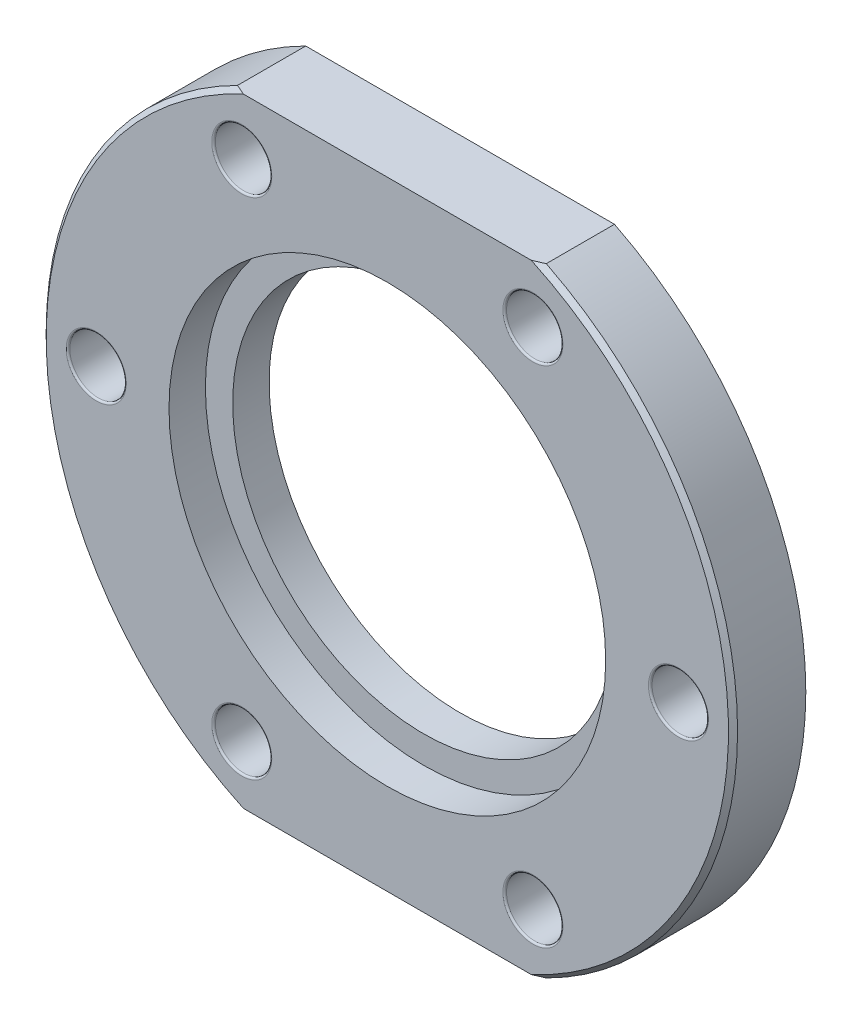
ISO-10303-21;
HEADER;
FILE_DESCRIPTION(('STEP AP214'),'2;1');
FILE_NAME('part.step','',(''),(''),'','','');
FILE_SCHEMA(('AUTOMOTIVE_DESIGN { 1 0 10303 214 1 1 1 1 }'));
ENDSEC;
DATA;
#1=APPLICATION_CONTEXT('core data for automotive mechanical design processes');
#2=APPLICATION_PROTOCOL_DEFINITION('international standard','automotive_design',2000,#1);
#3=PRODUCT_CONTEXT('',#1,'mechanical');
#4=PRODUCT('Part','Part','',(#3));
#5=PRODUCT_RELATED_PRODUCT_CATEGORY('part','',(#4));
#6=PRODUCT_DEFINITION_FORMATION('','',#4);
#7=PRODUCT_DEFINITION_CONTEXT('part definition',#1,'design');
#8=PRODUCT_DEFINITION('design','',#6,#7);
#9=PRODUCT_DEFINITION_SHAPE('','',#8);
#10=(LENGTH_UNIT() NAMED_UNIT(*) SI_UNIT(.MILLI.,.METRE.));
#11=(NAMED_UNIT(*) PLANE_ANGLE_UNIT() SI_UNIT($,.RADIAN.));
#12=(NAMED_UNIT(*) SI_UNIT($,.STERADIAN.) SOLID_ANGLE_UNIT());
#13=UNCERTAINTY_MEASURE_WITH_UNIT(LENGTH_MEASURE(1.E-05),#10,'distance_accuracy_value','');
#14=(GEOMETRIC_REPRESENTATION_CONTEXT(3) GLOBAL_UNCERTAINTY_ASSIGNED_CONTEXT((#13)) GLOBAL_UNIT_ASSIGNED_CONTEXT((#10,
#11,#12)) REPRESENTATION_CONTEXT('',''));
#15=CARTESIAN_POINT('',(0.,0.,0.));
#16=DIRECTION('',(0.,0.,1.));
#17=DIRECTION('',(1.,0.,0.));
#18=AXIS2_PLACEMENT_3D('',#15,#16,#17);
#19=CARTESIAN_POINT('',(0.,0.,4.));
#20=DIRECTION('',(0.,0.,-1.));
#21=DIRECTION('',(-1.,0.,0.));
#22=AXIS2_PLACEMENT_3D('',#19,#20,#21);
#23=CYLINDRICAL_SURFACE('',#22,19.);
#24=DIRECTION('',(0.,0.,1.));
#25=VECTOR('',#24,1.);
#26=CARTESIAN_POINT('',(-8.48528137423857,-17.,0.));
#27=LINE('',#26,#25);
#28=CARTESIAN_POINT('',(-8.48528137423857,-17.,0.));
#29=VERTEX_POINT('',#28);
#30=CARTESIAN_POINT('',(-8.48528137423857,-17.,3.75000000000001));
#31=VERTEX_POINT('',#30);
#32=EDGE_CURVE('E108',#29,#31,#27,.T.);
#33=ORIENTED_EDGE('',*,*,#32,.T.);
#34=CARTESIAN_POINT('',(0.,0.,3.75000000000001));
#35=DIRECTION('',(0.,0.,1.));
#36=DIRECTION('',(1.,0.,0.));
#37=AXIS2_PLACEMENT_3D('',#34,#35,#36);
#38=CIRCLE('',#37,19.);
#39=CARTESIAN_POINT('',(-8.48528137423857,17.,3.75000000000001));
#40=VERTEX_POINT('',#39);
#41=EDGE_CURVE('E11',#31,#40,#38,.F.);
#42=ORIENTED_EDGE('',*,*,#41,.T.);
#43=DIRECTION('',(0.,0.,1.));
#44=VECTOR('',#43,1.);
#45=CARTESIAN_POINT('',(-8.48528137423857,17.,0.));
#46=LINE('',#45,#44);
#47=CARTESIAN_POINT('',(-8.48528137423857,17.,0.));
#48=VERTEX_POINT('',#47);
#49=EDGE_CURVE('E355',#48,#40,#46,.T.);
#50=ORIENTED_EDGE('',*,*,#49,.F.);
#51=CARTESIAN_POINT('',(0.,0.,0.));
#52=DIRECTION('',(0.,0.,1.));
#53=DIRECTION('',(1.,0.,0.));
#54=AXIS2_PLACEMENT_3D('',#51,#52,#53);
#55=CIRCLE('',#54,19.);
#56=EDGE_CURVE('E126',#48,#29,#55,.T.);
#57=ORIENTED_EDGE('',*,*,#56,.T.);
#58=EDGE_LOOP('',(#33,#42,#50,#57));
#59=FACE_BOUND('',#58,.T.);
#60=ADVANCED_FACE('F49',(#59),#23,.T.);
#61=DIRECTION('',(0.,0.,1.));
#62=VECTOR('',#61,1.);
#63=CARTESIAN_POINT('',(8.48528137423857,17.,0.));
#64=LINE('',#63,#62);
#65=CARTESIAN_POINT('',(8.48528137423857,17.,0.));
#66=VERTEX_POINT('',#65);
#67=CARTESIAN_POINT('',(8.48528137423857,17.,3.75000000000001));
#68=VERTEX_POINT('',#67);
#69=EDGE_CURVE('E114',#66,#68,#64,.T.);
#70=ORIENTED_EDGE('',*,*,#69,.T.);
#71=CARTESIAN_POINT('',(0.,0.,3.75000000000001));
#72=DIRECTION('',(0.,0.,1.));
#73=DIRECTION('',(1.,0.,0.));
#74=AXIS2_PLACEMENT_3D('',#71,#72,#73);
#75=CIRCLE('',#74,19.);
#76=CARTESIAN_POINT('',(8.48528137423857,-17.,3.75000000000001));
#77=VERTEX_POINT('',#76);
#78=EDGE_CURVE('E75',#68,#77,#75,.F.);
#79=ORIENTED_EDGE('',*,*,#78,.T.);
#80=DIRECTION('',(0.,0.,1.));
#81=VECTOR('',#80,1.);
#82=CARTESIAN_POINT('',(8.48528137423857,-17.,0.));
#83=LINE('',#82,#81);
#84=CARTESIAN_POINT('',(8.48528137423857,-17.,0.));
#85=VERTEX_POINT('',#84);
#86=EDGE_CURVE('E106',#85,#77,#83,.T.);
#87=ORIENTED_EDGE('',*,*,#86,.F.);
#88=EDGE_CURVE('E118',#85,#66,#55,.T.);
#89=ORIENTED_EDGE('',*,*,#88,.T.);
#90=EDGE_LOOP('',(#70,#79,#87,#89));
#91=FACE_BOUND('',#90,.T.);
#92=ADVANCED_FACE('F117',(#91),#23,.T.);
#93=CARTESIAN_POINT('',(0.,0.,4.));
#94=DIRECTION('',(0.,0.,1.));
#95=DIRECTION('',(1.,0.,0.));
#96=AXIS2_PLACEMENT_3D('',#93,#94,#95);
#97=PLANE('',#96);
#98=CARTESIAN_POINT('',(0.,0.,4.));
#99=DIRECTION('',(0.,0.,1.));
#100=DIRECTION('',(1.,0.,0.));
#101=AXIS2_PLACEMENT_3D('',#98,#99,#100);
#102=CIRCLE('',#101,12.);
#103=CARTESIAN_POINT('',(12.,0.,4.));
#104=VERTEX_POINT('',#103);
#105=EDGE_CURVE('E236',#104,#104,#102,.F.);
#106=ORIENTED_EDGE('',*,*,#105,.T.);
#107=EDGE_LOOP('',(#106));
#108=FACE_BOUND('',#107,.T.);
#109=CARTESIAN_POINT('',(16.,-1.1172740284298E-13,4.));
#110=DIRECTION('',(0.,0.,1.));
#111=DIRECTION('',(1.,0.,0.));
#112=AXIS2_PLACEMENT_3D('',#109,#110,#111);
#113=CIRCLE('',#112,1.65);
#114=CARTESIAN_POINT('',(17.65,-1.1172740284298E-13,4.));
#115=VERTEX_POINT('',#114);
#116=EDGE_CURVE('E191',#115,#115,#113,.F.);
#117=ORIENTED_EDGE('',*,*,#116,.T.);
#118=EDGE_LOOP('',(#117));
#119=FACE_BOUND('',#118,.T.);
#120=CARTESIAN_POINT('',(7.99999999999987,-13.8564064605511,4.));
#121=DIRECTION('',(0.,0.,1.));
#122=DIRECTION('',(1.,0.,0.));
#123=AXIS2_PLACEMENT_3D('',#120,#121,#122);
#124=CIRCLE('',#123,1.65);
#125=CARTESIAN_POINT('',(9.64999999999987,-13.8564064605511,4.));
#126=VERTEX_POINT('',#125);
#127=EDGE_CURVE('E187',#126,#126,#124,.F.);
#128=ORIENTED_EDGE('',*,*,#127,.T.);
#129=EDGE_LOOP('',(#128));
#130=FACE_BOUND('',#129,.T.);
#131=CARTESIAN_POINT('',(-8.00000000000016,-13.8564064605509,4.));
#132=DIRECTION('',(0.,0.,1.));
#133=DIRECTION('',(1.,0.,0.));
#134=AXIS2_PLACEMENT_3D('',#131,#132,#133);
#135=CIRCLE('',#134,1.65);
#136=CARTESIAN_POINT('',(-6.35000000000016,-13.8564064605509,4.));
#137=VERTEX_POINT('',#136);
#138=EDGE_CURVE('E183',#137,#137,#135,.F.);
#139=ORIENTED_EDGE('',*,*,#138,.T.);
#140=EDGE_LOOP('',(#139));
#141=FACE_BOUND('',#140,.T.);
#142=CARTESIAN_POINT('',(-16.,0.,4.));
#143=DIRECTION('',(0.,0.,1.));
#144=DIRECTION('',(1.,0.,0.));
#145=AXIS2_PLACEMENT_3D('',#142,#143,#144);
#146=CIRCLE('',#145,1.65);
#147=CARTESIAN_POINT('',(-14.35,0.,4.));
#148=VERTEX_POINT('',#147);
#149=EDGE_CURVE('E179',#148,#148,#146,.F.);
#150=ORIENTED_EDGE('',*,*,#149,.T.);
#151=EDGE_LOOP('',(#150));
#152=FACE_BOUND('',#151,.T.);
#153=CARTESIAN_POINT('',(8.00000000000007,13.856406460551,4.));
#154=DIRECTION('',(0.,0.,1.));
#155=DIRECTION('',(1.,0.,0.));
#156=AXIS2_PLACEMENT_3D('',#153,#154,#155);
#157=CIRCLE('',#156,1.65);
#158=CARTESIAN_POINT('',(9.65000000000007,13.856406460551,4.));
#159=VERTEX_POINT('',#158);
#160=EDGE_CURVE('E175',#159,#159,#157,.F.);
#161=ORIENTED_EDGE('',*,*,#160,.T.);
#162=EDGE_LOOP('',(#161));
#163=FACE_BOUND('',#162,.T.);
#164=CARTESIAN_POINT('',(-7.99999999999997,13.856406460551,4.));
#165=DIRECTION('',(0.,0.,1.));
#166=DIRECTION('',(1.,0.,0.));
#167=AXIS2_PLACEMENT_3D('',#164,#165,#166);
#168=CIRCLE('',#167,1.65);
#169=CARTESIAN_POINT('',(-6.34999999999997,13.856406460551,4.));
#170=VERTEX_POINT('',#169);
#171=EDGE_CURVE('E171',#170,#170,#168,.F.);
#172=ORIENTED_EDGE('',*,*,#171,.T.);
#173=EDGE_LOOP('',(#172));
#174=FACE_BOUND('',#173,.T.);
#175=DIRECTION('',(1.,0.,0.));
#176=VECTOR('',#175,1.);
#177=CARTESIAN_POINT('',(0.,-17.,4.));
#178=LINE('',#177,#176);
#179=CARTESIAN_POINT('',(-7.90964600977821,-17.,4.));
#180=VERTEX_POINT('',#179);
#181=CARTESIAN_POINT('',(7.90964600977821,-17.,4.));
#182=VERTEX_POINT('',#181);
#183=EDGE_CURVE('E127',#180,#182,#178,.T.);
#184=ORIENTED_EDGE('',*,*,#183,.T.);
#185=CARTESIAN_POINT('',(0.,0.,4.));
#186=DIRECTION('',(0.,0.,1.));
#187=DIRECTION('',(1.,0.,0.));
#188=AXIS2_PLACEMENT_3D('',#185,#186,#187);
#189=CIRCLE('',#188,18.75);
#190=CARTESIAN_POINT('',(7.90964600977821,17.,4.));
#191=VERTEX_POINT('',#190);
#192=EDGE_CURVE('E244',#182,#191,#189,.T.);
#193=ORIENTED_EDGE('',*,*,#192,.T.);
#194=DIRECTION('',(1.,0.,0.));
#195=VECTOR('',#194,1.);
#196=CARTESIAN_POINT('',(0.,17.,4.));
#197=LINE('',#196,#195);
#198=CARTESIAN_POINT('',(-7.90964600977821,17.,4.));
#199=VERTEX_POINT('',#198);
#200=EDGE_CURVE('E120',#199,#191,#197,.T.);
#201=ORIENTED_EDGE('',*,*,#200,.F.);
#202=CARTESIAN_POINT('',(0.,0.,4.));
#203=DIRECTION('',(0.,0.,1.));
#204=DIRECTION('',(1.,0.,0.));
#205=AXIS2_PLACEMENT_3D('',#202,#203,#204);
#206=CIRCLE('',#205,18.75);
#207=EDGE_CURVE('E235',#199,#180,#206,.T.);
#208=ORIENTED_EDGE('',*,*,#207,.T.);
#209=EDGE_LOOP('',(#184,#193,#201,#208));
#210=FACE_BOUND('',#209,.T.);
#211=ADVANCED_FACE('F270',(#108,#119,#130,#141,#152,#163,#174,#210),#97,.T.);
#212=CARTESIAN_POINT('',(0.,0.,0.));
#213=DIRECTION('',(0.,0.,1.));
#214=DIRECTION('',(1.,0.,0.));
#215=AXIS2_PLACEMENT_3D('',#212,#213,#214);
#216=PLANE('',#215);
#217=CARTESIAN_POINT('',(0.,0.,0.));
#218=DIRECTION('',(0.,0.,1.));
#219=DIRECTION('',(1.,0.,0.));
#220=AXIS2_PLACEMENT_3D('',#217,#218,#219);
#221=CIRCLE('',#220,10.5);
#222=CARTESIAN_POINT('',(10.5,0.,0.));
#223=VERTEX_POINT('',#222);
#224=EDGE_CURVE('E372',#223,#223,#221,.T.);
#225=ORIENTED_EDGE('',*,*,#224,.T.);
#226=EDGE_LOOP('',(#225));
#227=FACE_BOUND('',#226,.T.);
#228=CARTESIAN_POINT('',(16.,-1.1172740284298E-13,0.));
#229=DIRECTION('',(0.,0.,1.));
#230=DIRECTION('',(1.,0.,0.));
#231=AXIS2_PLACEMENT_3D('',#228,#229,#230);
#232=CIRCLE('',#231,1.65);
#233=CARTESIAN_POINT('',(17.65,-1.1172740284298E-13,0.));
#234=VERTEX_POINT('',#233);
#235=EDGE_CURVE('E159',#234,#234,#232,.T.);
#236=ORIENTED_EDGE('',*,*,#235,.T.);
#237=EDGE_LOOP('',(#236));
#238=FACE_BOUND('',#237,.T.);
#239=CARTESIAN_POINT('',(7.99999999999987,-13.8564064605511,0.));
#240=DIRECTION('',(0.,0.,1.));
#241=DIRECTION('',(1.,0.,0.));
#242=AXIS2_PLACEMENT_3D('',#239,#240,#241);
#243=CIRCLE('',#242,1.65);
#244=CARTESIAN_POINT('',(9.64999999999987,-13.8564064605511,0.));
#245=VERTEX_POINT('',#244);
#246=EDGE_CURVE('E155',#245,#245,#243,.T.);
#247=ORIENTED_EDGE('',*,*,#246,.T.);
#248=EDGE_LOOP('',(#247));
#249=FACE_BOUND('',#248,.T.);
#250=CARTESIAN_POINT('',(-8.00000000000016,-13.8564064605509,0.));
#251=DIRECTION('',(0.,0.,1.));
#252=DIRECTION('',(1.,0.,0.));
#253=AXIS2_PLACEMENT_3D('',#250,#251,#252);
#254=CIRCLE('',#253,1.65);
#255=CARTESIAN_POINT('',(-6.35000000000016,-13.8564064605509,0.));
#256=VERTEX_POINT('',#255);
#257=EDGE_CURVE('E151',#256,#256,#254,.T.);
#258=ORIENTED_EDGE('',*,*,#257,.T.);
#259=EDGE_LOOP('',(#258));
#260=FACE_BOUND('',#259,.T.);
#261=CARTESIAN_POINT('',(-16.,0.,0.));
#262=DIRECTION('',(0.,0.,1.));
#263=DIRECTION('',(1.,0.,0.));
#264=AXIS2_PLACEMENT_3D('',#261,#262,#263);
#265=CIRCLE('',#264,1.65);
#266=CARTESIAN_POINT('',(-14.35,0.,0.));
#267=VERTEX_POINT('',#266);
#268=EDGE_CURVE('E147',#267,#267,#265,.T.);
#269=ORIENTED_EDGE('',*,*,#268,.T.);
#270=EDGE_LOOP('',(#269));
#271=FACE_BOUND('',#270,.T.);
#272=CARTESIAN_POINT('',(8.00000000000007,13.856406460551,0.));
#273=DIRECTION('',(0.,0.,1.));
#274=DIRECTION('',(1.,0.,0.));
#275=AXIS2_PLACEMENT_3D('',#272,#273,#274);
#276=CIRCLE('',#275,1.65);
#277=CARTESIAN_POINT('',(9.65000000000007,13.856406460551,0.));
#278=VERTEX_POINT('',#277);
#279=EDGE_CURVE('E143',#278,#278,#276,.T.);
#280=ORIENTED_EDGE('',*,*,#279,.T.);
#281=EDGE_LOOP('',(#280));
#282=FACE_BOUND('',#281,.T.);
#283=CARTESIAN_POINT('',(-7.99999999999997,13.856406460551,0.));
#284=DIRECTION('',(0.,0.,1.));
#285=DIRECTION('',(1.,0.,0.));
#286=AXIS2_PLACEMENT_3D('',#283,#284,#285);
#287=CIRCLE('',#286,1.65);
#288=CARTESIAN_POINT('',(-6.34999999999997,13.856406460551,0.));
#289=VERTEX_POINT('',#288);
#290=EDGE_CURVE('E131',#289,#289,#287,.T.);
#291=ORIENTED_EDGE('',*,*,#290,.T.);
#292=EDGE_LOOP('',(#291));
#293=FACE_BOUND('',#292,.T.);
#294=DIRECTION('',(1.,0.,0.));
#295=VECTOR('',#294,1.);
#296=CARTESIAN_POINT('',(0.,-17.,0.));
#297=LINE('',#296,#295);
#298=EDGE_CURVE('E104',#29,#85,#297,.T.);
#299=ORIENTED_EDGE('',*,*,#298,.F.);
#300=ORIENTED_EDGE('',*,*,#56,.F.);
#301=DIRECTION('',(1.,0.,0.));
#302=VECTOR('',#301,1.);
#303=CARTESIAN_POINT('',(0.,17.,0.));
#304=LINE('',#303,#302);
#305=EDGE_CURVE('E124',#48,#66,#304,.T.);
#306=ORIENTED_EDGE('',*,*,#305,.T.);
#307=ORIENTED_EDGE('',*,*,#88,.F.);
#308=EDGE_LOOP('',(#299,#300,#306,#307));
#309=FACE_BOUND('',#308,.T.);
#310=ADVANCED_FACE('F123',(#227,#238,#249,#260,#271,#282,#293,#309),#216,.F.);
#311=CARTESIAN_POINT('',(0.,17.,0.));
#312=DIRECTION('',(0.,-1.,0.));
#313=DIRECTION('',(0.,0.,-1.));
#314=AXIS2_PLACEMENT_3D('',#311,#312,#313);
#315=PLANE('',#314);
#316=ORIENTED_EDGE('',*,*,#200,.T.);
#317=CARTESIAN_POINT('',(7.90964600977821,17.,4.));
#318=CARTESIAN_POINT('',(8.00601897836247,17.,3.95933199325902));
#319=CARTESIAN_POINT('',(8.10217508492686,17.,3.91816465272795));
#320=CARTESIAN_POINT('',(8.29405353959135,17.,3.83483131903628));
#321=CARTESIAN_POINT('',(8.38977588784708,17.,3.79266532623403));
#322=CARTESIAN_POINT('',(8.48528137423857,17.,3.75000000000001));
#323=B_SPLINE_CURVE_WITH_KNOTS('',3,(#317,#318,#319,#320,#321,#322),.UNSPECIFIED.,.F.,.F.,(4,2,
4),(0.,0.3137940738832,0.627588035172001),.UNSPECIFIED.);
#324=EDGE_CURVE('E256',#191,#68,#323,.T.);
#325=ORIENTED_EDGE('',*,*,#324,.T.);
#326=ORIENTED_EDGE('',*,*,#69,.F.);
#327=ORIENTED_EDGE('',*,*,#305,.F.);
#328=ORIENTED_EDGE('',*,*,#49,.T.);
#329=CARTESIAN_POINT('',(-8.48528137423857,17.,3.75000000000001));
#330=CARTESIAN_POINT('',(-8.38977588784708,17.,3.79266532623403));
#331=CARTESIAN_POINT('',(-8.29405353959135,17.,3.83483131903628));
#332=CARTESIAN_POINT('',(-8.10217508492686,17.,3.91816465272795));
#333=CARTESIAN_POINT('',(-8.00601897836247,17.,3.95933199325902));
#334=CARTESIAN_POINT('',(-7.90964600977821,17.,4.));
#335=B_SPLINE_CURVE_WITH_KNOTS('',3,(#329,#330,#331,#332,#333,#334),.UNSPECIFIED.,.F.,.F.,(4,2,
4),(0.,0.3137939612888,0.627588035172001),.UNSPECIFIED.);
#336=EDGE_CURVE('E248',#40,#199,#335,.T.);
#337=ORIENTED_EDGE('',*,*,#336,.T.);
#338=EDGE_LOOP('',(#316,#325,#326,#327,#328,#337));
#339=FACE_BOUND('',#338,.T.);
#340=ADVANCED_FACE('F262',(#339),#315,.F.);
#341=CARTESIAN_POINT('',(0.,-17.,0.));
#342=DIRECTION('',(0.,-1.,0.));
#343=DIRECTION('',(0.,0.,-1.));
#344=AXIS2_PLACEMENT_3D('',#341,#342,#343);
#345=PLANE('',#344);
#346=ORIENTED_EDGE('',*,*,#86,.T.);
#347=CARTESIAN_POINT('',(8.48528137423857,-17.,3.75000000000001));
#348=CARTESIAN_POINT('',(8.38977588784708,-17.,3.79266532623403));
#349=CARTESIAN_POINT('',(8.29405353959135,-17.,3.83483131903628));
#350=CARTESIAN_POINT('',(8.10217508492686,-17.,3.91816465272795));
#351=CARTESIAN_POINT('',(8.00601897836247,-17.,3.95933199325902));
#352=CARTESIAN_POINT('',(7.90964600977821,-17.,4.));
#353=B_SPLINE_CURVE_WITH_KNOTS('',3,(#347,#348,#349,#350,#351,#352),.UNSPECIFIED.,.F.,.F.,(4,2,
4),(0.,0.3137939612888,0.627588035172001),.UNSPECIFIED.);
#354=EDGE_CURVE('E60',#77,#182,#353,.T.);
#355=ORIENTED_EDGE('',*,*,#354,.T.);
#356=ORIENTED_EDGE('',*,*,#183,.F.);
#357=CARTESIAN_POINT('',(-7.90964600977821,-17.,4.));
#358=CARTESIAN_POINT('',(-8.00601897836247,-17.,3.95933199325902));
#359=CARTESIAN_POINT('',(-8.10217508492686,-17.,3.91816465272795));
#360=CARTESIAN_POINT('',(-8.29405353959135,-17.,3.83483131903628));
#361=CARTESIAN_POINT('',(-8.38977588784708,-17.,3.79266532623403));
#362=CARTESIAN_POINT('',(-8.48528137423857,-17.,3.75000000000001));
#363=B_SPLINE_CURVE_WITH_KNOTS('',3,(#357,#358,#359,#360,#361,#362),.UNSPECIFIED.,.F.,.F.,(4,2,
4),(0.,0.3137940738832,0.627588035172001),.UNSPECIFIED.);
#364=EDGE_CURVE('E67',#180,#31,#363,.T.);
#365=ORIENTED_EDGE('',*,*,#364,.T.);
#366=ORIENTED_EDGE('',*,*,#32,.F.);
#367=ORIENTED_EDGE('',*,*,#298,.T.);
#368=EDGE_LOOP('',(#346,#355,#356,#365,#366,#367));
#369=FACE_BOUND('',#368,.T.);
#370=ADVANCED_FACE('F105',(#369),#345,.T.);
#371=CARTESIAN_POINT('',(-7.99999999999997,13.856406460551,0.));
#372=DIRECTION('',(0.,0.,1.));
#373=DIRECTION('',(1.,0.,0.));
#374=AXIS2_PLACEMENT_3D('',#371,#372,#373);
#375=CYLINDRICAL_SURFACE('',#374,1.55);
#376=CARTESIAN_POINT('',(-7.99999999999997,13.856406460551,0.1));
#377=DIRECTION('',(0.,0.,1.));
#378=DIRECTION('',(1.,0.,0.));
#379=AXIS2_PLACEMENT_3D('',#376,#377,#378);
#380=CIRCLE('',#379,1.55);
#381=CARTESIAN_POINT('',(-6.44999999999997,13.856406460551,0.1));
#382=VERTEX_POINT('',#381);
#383=EDGE_CURVE('E231',#382,#382,#380,.F.);
#384=ORIENTED_EDGE('',*,*,#383,.T.);
#385=EDGE_LOOP('',(#384));
#386=FACE_BOUND('',#385,.T.);
#387=CARTESIAN_POINT('',(-7.99999999999997,13.856406460551,3.9));
#388=DIRECTION('',(0.,0.,1.));
#389=DIRECTION('',(1.,0.,0.));
#390=AXIS2_PLACEMENT_3D('',#387,#388,#389);
#391=CIRCLE('',#390,1.55);
#392=CARTESIAN_POINT('',(-6.44999999999997,13.856406460551,3.9));
#393=VERTEX_POINT('',#392);
#394=EDGE_CURVE('E227',#393,#393,#391,.T.);
#395=ORIENTED_EDGE('',*,*,#394,.T.);
#396=EDGE_LOOP('',(#395));
#397=FACE_BOUND('',#396,.T.);
#398=ADVANCED_FACE('F408',(#386,#397),#375,.F.);
#399=CARTESIAN_POINT('',(8.00000000000007,13.856406460551,0.));
#400=DIRECTION('',(0.,0.,1.));
#401=DIRECTION('',(1.,0.,0.));
#402=AXIS2_PLACEMENT_3D('',#399,#400,#401);
#403=CYLINDRICAL_SURFACE('',#402,1.55);
#404=CARTESIAN_POINT('',(8.00000000000007,13.856406460551,0.1));
#405=DIRECTION('',(0.,0.,1.));
#406=DIRECTION('',(1.,0.,0.));
#407=AXIS2_PLACEMENT_3D('',#404,#405,#406);
#408=CIRCLE('',#407,1.55);
#409=CARTESIAN_POINT('',(9.55000000000006,13.856406460551,0.1));
#410=VERTEX_POINT('',#409);
#411=EDGE_CURVE('E223',#410,#410,#408,.F.);
#412=ORIENTED_EDGE('',*,*,#411,.T.);
#413=EDGE_LOOP('',(#412));
#414=FACE_BOUND('',#413,.T.);
#415=CARTESIAN_POINT('',(8.00000000000007,13.856406460551,3.9));
#416=DIRECTION('',(0.,0.,1.));
#417=DIRECTION('',(1.,0.,0.));
#418=AXIS2_PLACEMENT_3D('',#415,#416,#417);
#419=CIRCLE('',#418,1.55);
#420=CARTESIAN_POINT('',(9.55000000000006,13.856406460551,3.9));
#421=VERTEX_POINT('',#420);
#422=EDGE_CURVE('E219',#421,#421,#419,.T.);
#423=ORIENTED_EDGE('',*,*,#422,.T.);
#424=EDGE_LOOP('',(#423));
#425=FACE_BOUND('',#424,.T.);
#426=ADVANCED_FACE('F411',(#414,#425),#403,.F.);
#427=CARTESIAN_POINT('',(16.,-1.1172740284298E-13,0.));
#428=DIRECTION('',(0.,0.,1.));
#429=DIRECTION('',(1.,0.,0.));
#430=AXIS2_PLACEMENT_3D('',#427,#428,#429);
#431=CYLINDRICAL_SURFACE('',#430,1.55);
#432=CARTESIAN_POINT('',(16.,-1.1172740284298E-13,0.1));
#433=DIRECTION('',(0.,0.,1.));
#434=DIRECTION('',(1.,0.,0.));
#435=AXIS2_PLACEMENT_3D('',#432,#433,#434);
#436=CIRCLE('',#435,1.55);
#437=CARTESIAN_POINT('',(17.55,-1.1172740284298E-13,0.1));
#438=VERTEX_POINT('',#437);
#439=EDGE_CURVE('E167',#438,#438,#436,.F.);
#440=ORIENTED_EDGE('',*,*,#439,.T.);
#441=EDGE_LOOP('',(#440));
#442=FACE_BOUND('',#441,.T.);
#443=CARTESIAN_POINT('',(16.,-1.1172740284298E-13,3.9));
#444=DIRECTION('',(0.,0.,1.));
#445=DIRECTION('',(1.,0.,0.));
#446=AXIS2_PLACEMENT_3D('',#443,#444,#445);
#447=CIRCLE('',#446,1.55);
#448=CARTESIAN_POINT('',(17.55,-1.1172740284298E-13,3.9));
#449=VERTEX_POINT('',#448);
#450=EDGE_CURVE('E163',#449,#449,#447,.T.);
#451=ORIENTED_EDGE('',*,*,#450,.T.);
#452=EDGE_LOOP('',(#451));
#453=FACE_BOUND('',#452,.T.);
#454=ADVANCED_FACE('F415',(#442,#453),#431,.F.);
#455=CARTESIAN_POINT('',(7.99999999999987,-13.8564064605511,0.));
#456=DIRECTION('',(0.,0.,1.));
#457=DIRECTION('',(1.,0.,0.));
#458=AXIS2_PLACEMENT_3D('',#455,#456,#457);
#459=CYLINDRICAL_SURFACE('',#458,1.55);
#460=CARTESIAN_POINT('',(7.99999999999987,-13.8564064605511,0.1));
#461=DIRECTION('',(0.,0.,1.));
#462=DIRECTION('',(1.,0.,0.));
#463=AXIS2_PLACEMENT_3D('',#460,#461,#462);
#464=CIRCLE('',#463,1.55);
#465=CARTESIAN_POINT('',(9.54999999999987,-13.8564064605511,0.1));
#466=VERTEX_POINT('',#465);
#467=EDGE_CURVE('E199',#466,#466,#464,.F.);
#468=ORIENTED_EDGE('',*,*,#467,.T.);
#469=EDGE_LOOP('',(#468));
#470=FACE_BOUND('',#469,.T.);
#471=CARTESIAN_POINT('',(7.99999999999987,-13.8564064605511,3.9));
#472=DIRECTION('',(0.,0.,1.));
#473=DIRECTION('',(1.,0.,0.));
#474=AXIS2_PLACEMENT_3D('',#471,#472,#473);
#475=CIRCLE('',#474,1.55);
#476=CARTESIAN_POINT('',(9.54999999999987,-13.8564064605511,3.9));
#477=VERTEX_POINT('',#476);
#478=EDGE_CURVE('E195',#477,#477,#475,.T.);
#479=ORIENTED_EDGE('',*,*,#478,.T.);
#480=EDGE_LOOP('',(#479));
#481=FACE_BOUND('',#480,.T.);
#482=ADVANCED_FACE('F406',(#470,#481),#459,.F.);
#483=CARTESIAN_POINT('',(-8.00000000000016,-13.8564064605509,0.));
#484=DIRECTION('',(0.,0.,1.));
#485=DIRECTION('',(1.,0.,0.));
#486=AXIS2_PLACEMENT_3D('',#483,#484,#485);
#487=CYLINDRICAL_SURFACE('',#486,1.55);
#488=CARTESIAN_POINT('',(-8.00000000000016,-13.8564064605509,0.1));
#489=DIRECTION('',(0.,0.,1.));
#490=DIRECTION('',(1.,0.,0.));
#491=AXIS2_PLACEMENT_3D('',#488,#489,#490);
#492=CIRCLE('',#491,1.55);
#493=CARTESIAN_POINT('',(-6.45000000000016,-13.8564064605509,0.1));
#494=VERTEX_POINT('',#493);
#495=EDGE_CURVE('E207',#494,#494,#492,.F.);
#496=ORIENTED_EDGE('',*,*,#495,.T.);
#497=EDGE_LOOP('',(#496));
#498=FACE_BOUND('',#497,.T.);
#499=CARTESIAN_POINT('',(-8.00000000000016,-13.8564064605509,3.9));
#500=DIRECTION('',(0.,0.,1.));
#501=DIRECTION('',(1.,0.,0.));
#502=AXIS2_PLACEMENT_3D('',#499,#500,#501);
#503=CIRCLE('',#502,1.55);
#504=CARTESIAN_POINT('',(-6.45000000000016,-13.8564064605509,3.9));
#505=VERTEX_POINT('',#504);
#506=EDGE_CURVE('E203',#505,#505,#503,.T.);
#507=ORIENTED_EDGE('',*,*,#506,.T.);
#508=EDGE_LOOP('',(#507));
#509=FACE_BOUND('',#508,.T.);
#510=ADVANCED_FACE('F402',(#498,#509),#487,.F.);
#511=CARTESIAN_POINT('',(-16.,0.,0.));
#512=DIRECTION('',(0.,0.,1.));
#513=DIRECTION('',(1.,0.,0.));
#514=AXIS2_PLACEMENT_3D('',#511,#512,#513);
#515=CYLINDRICAL_SURFACE('',#514,1.55);
#516=CARTESIAN_POINT('',(-16.,0.,0.1));
#517=DIRECTION('',(0.,0.,1.));
#518=DIRECTION('',(1.,0.,0.));
#519=AXIS2_PLACEMENT_3D('',#516,#517,#518);
#520=CIRCLE('',#519,1.55);
#521=CARTESIAN_POINT('',(-14.45,0.,0.1));
#522=VERTEX_POINT('',#521);
#523=EDGE_CURVE('E215',#522,#522,#520,.F.);
#524=ORIENTED_EDGE('',*,*,#523,.T.);
#525=EDGE_LOOP('',(#524));
#526=FACE_BOUND('',#525,.T.);
#527=CARTESIAN_POINT('',(-16.,0.,3.9));
#528=DIRECTION('',(0.,0.,1.));
#529=DIRECTION('',(1.,0.,0.));
#530=AXIS2_PLACEMENT_3D('',#527,#528,#529);
#531=CIRCLE('',#530,1.55);
#532=CARTESIAN_POINT('',(-14.45,0.,3.9));
#533=VERTEX_POINT('',#532);
#534=EDGE_CURVE('E211',#533,#533,#531,.T.);
#535=ORIENTED_EDGE('',*,*,#534,.T.);
#536=EDGE_LOOP('',(#535));
#537=FACE_BOUND('',#536,.T.);
#538=ADVANCED_FACE('F285',(#526,#537),#515,.F.);
#539=CARTESIAN_POINT('',(16.,-1.1172740284298E-13,0.1));
#540=DIRECTION('',(0.,0.,1.));
#541=DIRECTION('',(1.,0.,0.));
#542=AXIS2_PLACEMENT_3D('',#539,#540,#541);
#543=TOROIDAL_SURFACE('',#542,1.65,0.1);
#544=ORIENTED_EDGE('',*,*,#439,.F.);
#545=EDGE_LOOP('',(#544));
#546=FACE_BOUND('',#545,.T.);
#547=ORIENTED_EDGE('',*,*,#235,.F.);
#548=EDGE_LOOP('',(#547));
#549=FACE_BOUND('',#548,.T.);
#550=ADVANCED_FACE('F281',(#546,#549),#543,.T.);
#551=CARTESIAN_POINT('',(16.,-1.1172740284298E-13,3.9));
#552=DIRECTION('',(0.,0.,1.));
#553=DIRECTION('',(1.,0.,0.));
#554=AXIS2_PLACEMENT_3D('',#551,#552,#553);
#555=TOROIDAL_SURFACE('',#554,1.65,0.1);
#556=ORIENTED_EDGE('',*,*,#116,.F.);
#557=EDGE_LOOP('',(#556));
#558=FACE_BOUND('',#557,.T.);
#559=ORIENTED_EDGE('',*,*,#450,.F.);
#560=EDGE_LOOP('',(#559));
#561=FACE_BOUND('',#560,.T.);
#562=ADVANCED_FACE('F284',(#558,#561),#555,.T.);
#563=CARTESIAN_POINT('',(7.99999999999987,-13.8564064605511,0.1));
#564=DIRECTION('',(0.,0.,1.));
#565=DIRECTION('',(1.,0.,0.));
#566=AXIS2_PLACEMENT_3D('',#563,#564,#565);
#567=TOROIDAL_SURFACE('',#566,1.65,0.1);
#568=ORIENTED_EDGE('',*,*,#467,.F.);
#569=EDGE_LOOP('',(#568));
#570=FACE_BOUND('',#569,.T.);
#571=ORIENTED_EDGE('',*,*,#246,.F.);
#572=EDGE_LOOP('',(#571));
#573=FACE_BOUND('',#572,.T.);
#574=ADVANCED_FACE('F289',(#570,#573),#567,.T.);
#575=CARTESIAN_POINT('',(7.99999999999987,-13.8564064605511,3.9));
#576=DIRECTION('',(0.,0.,1.));
#577=DIRECTION('',(1.,0.,0.));
#578=AXIS2_PLACEMENT_3D('',#575,#576,#577);
#579=TOROIDAL_SURFACE('',#578,1.65,0.1);
#580=ORIENTED_EDGE('',*,*,#127,.F.);
#581=EDGE_LOOP('',(#580));
#582=FACE_BOUND('',#581,.T.);
#583=ORIENTED_EDGE('',*,*,#478,.F.);
#584=EDGE_LOOP('',(#583));
#585=FACE_BOUND('',#584,.T.);
#586=ADVANCED_FACE('F293',(#582,#585),#579,.T.);
#587=CARTESIAN_POINT('',(-8.00000000000016,-13.8564064605509,0.1));
#588=DIRECTION('',(0.,0.,1.));
#589=DIRECTION('',(1.,0.,0.));
#590=AXIS2_PLACEMENT_3D('',#587,#588,#589);
#591=TOROIDAL_SURFACE('',#590,1.65,0.1);
#592=ORIENTED_EDGE('',*,*,#495,.F.);
#593=EDGE_LOOP('',(#592));
#594=FACE_BOUND('',#593,.T.);
#595=ORIENTED_EDGE('',*,*,#257,.F.);
#596=EDGE_LOOP('',(#595));
#597=FACE_BOUND('',#596,.T.);
#598=ADVANCED_FACE('F297',(#594,#597),#591,.T.);
#599=CARTESIAN_POINT('',(-8.00000000000016,-13.8564064605509,3.9));
#600=DIRECTION('',(0.,0.,1.));
#601=DIRECTION('',(1.,0.,0.));
#602=AXIS2_PLACEMENT_3D('',#599,#600,#601);
#603=TOROIDAL_SURFACE('',#602,1.65,0.1);
#604=ORIENTED_EDGE('',*,*,#138,.F.);
#605=EDGE_LOOP('',(#604));
#606=FACE_BOUND('',#605,.T.);
#607=ORIENTED_EDGE('',*,*,#506,.F.);
#608=EDGE_LOOP('',(#607));
#609=FACE_BOUND('',#608,.T.);
#610=ADVANCED_FACE('F301',(#606,#609),#603,.T.);
#611=CARTESIAN_POINT('',(-16.,0.,0.1));
#612=DIRECTION('',(0.,0.,1.));
#613=DIRECTION('',(1.,0.,0.));
#614=AXIS2_PLACEMENT_3D('',#611,#612,#613);
#615=TOROIDAL_SURFACE('',#614,1.65,0.1);
#616=ORIENTED_EDGE('',*,*,#523,.F.);
#617=EDGE_LOOP('',(#616));
#618=FACE_BOUND('',#617,.T.);
#619=ORIENTED_EDGE('',*,*,#268,.F.);
#620=EDGE_LOOP('',(#619));
#621=FACE_BOUND('',#620,.T.);
#622=ADVANCED_FACE('F305',(#618,#621),#615,.T.);
#623=CARTESIAN_POINT('',(-16.,0.,3.9));
#624=DIRECTION('',(0.,0.,1.));
#625=DIRECTION('',(1.,0.,0.));
#626=AXIS2_PLACEMENT_3D('',#623,#624,#625);
#627=TOROIDAL_SURFACE('',#626,1.65,0.1);
#628=ORIENTED_EDGE('',*,*,#149,.F.);
#629=EDGE_LOOP('',(#628));
#630=FACE_BOUND('',#629,.T.);
#631=ORIENTED_EDGE('',*,*,#534,.F.);
#632=EDGE_LOOP('',(#631));
#633=FACE_BOUND('',#632,.T.);
#634=ADVANCED_FACE('F309',(#630,#633),#627,.T.);
#635=CARTESIAN_POINT('',(8.00000000000007,13.856406460551,0.1));
#636=DIRECTION('',(0.,0.,1.));
#637=DIRECTION('',(1.,0.,0.));
#638=AXIS2_PLACEMENT_3D('',#635,#636,#637);
#639=TOROIDAL_SURFACE('',#638,1.65,0.1);
#640=ORIENTED_EDGE('',*,*,#411,.F.);
#641=EDGE_LOOP('',(#640));
#642=FACE_BOUND('',#641,.T.);
#643=ORIENTED_EDGE('',*,*,#279,.F.);
#644=EDGE_LOOP('',(#643));
#645=FACE_BOUND('',#644,.T.);
#646=ADVANCED_FACE('F313',(#642,#645),#639,.T.);
#647=CARTESIAN_POINT('',(8.00000000000007,13.856406460551,3.9));
#648=DIRECTION('',(0.,0.,1.));
#649=DIRECTION('',(1.,0.,0.));
#650=AXIS2_PLACEMENT_3D('',#647,#648,#649);
#651=TOROIDAL_SURFACE('',#650,1.65,0.1);
#652=ORIENTED_EDGE('',*,*,#160,.F.);
#653=EDGE_LOOP('',(#652));
#654=FACE_BOUND('',#653,.T.);
#655=ORIENTED_EDGE('',*,*,#422,.F.);
#656=EDGE_LOOP('',(#655));
#657=FACE_BOUND('',#656,.T.);
#658=ADVANCED_FACE('F317',(#654,#657),#651,.T.);
#659=CARTESIAN_POINT('',(-7.99999999999997,13.856406460551,0.1));
#660=DIRECTION('',(0.,0.,1.));
#661=DIRECTION('',(1.,0.,0.));
#662=AXIS2_PLACEMENT_3D('',#659,#660,#661);
#663=TOROIDAL_SURFACE('',#662,1.65,0.1);
#664=ORIENTED_EDGE('',*,*,#383,.F.);
#665=EDGE_LOOP('',(#664));
#666=FACE_BOUND('',#665,.T.);
#667=ORIENTED_EDGE('',*,*,#290,.F.);
#668=EDGE_LOOP('',(#667));
#669=FACE_BOUND('',#668,.T.);
#670=ADVANCED_FACE('F321',(#666,#669),#663,.T.);
#671=CARTESIAN_POINT('',(-7.99999999999997,13.856406460551,3.9));
#672=DIRECTION('',(0.,0.,1.));
#673=DIRECTION('',(1.,0.,0.));
#674=AXIS2_PLACEMENT_3D('',#671,#672,#673);
#675=TOROIDAL_SURFACE('',#674,1.65,0.1);
#676=ORIENTED_EDGE('',*,*,#171,.F.);
#677=EDGE_LOOP('',(#676));
#678=FACE_BOUND('',#677,.T.);
#679=ORIENTED_EDGE('',*,*,#394,.F.);
#680=EDGE_LOOP('',(#679));
#681=FACE_BOUND('',#680,.T.);
#682=ADVANCED_FACE('F325',(#678,#681),#675,.T.);
#683=CARTESIAN_POINT('',(0.,0.,4.000012));
#684=DIRECTION('',(0.,0.,-1.));
#685=DIRECTION('',(-1.,0.,0.));
#686=AXIS2_PLACEMENT_3D('',#683,#684,#685);
#687=CYLINDRICAL_SURFACE('',#686,12.);
#688=ORIENTED_EDGE('',*,*,#105,.F.);
#689=EDGE_LOOP('',(#688));
#690=FACE_BOUND('',#689,.T.);
#691=CARTESIAN_POINT('',(0.,0.,2.));
#692=DIRECTION('',(0.,0.,1.));
#693=DIRECTION('',(1.,0.,0.));
#694=AXIS2_PLACEMENT_3D('',#691,#692,#693);
#695=CIRCLE('',#694,12.);
#696=CARTESIAN_POINT('',(12.,0.,2.));
#697=VERTEX_POINT('',#696);
#698=EDGE_CURVE('E240',#697,#697,#695,.T.);
#699=ORIENTED_EDGE('',*,*,#698,.F.);
#700=EDGE_LOOP('',(#699));
#701=FACE_BOUND('',#700,.T.);
#702=ADVANCED_FACE('F328',(#690,#701),#687,.F.);
#703=CARTESIAN_POINT('',(0.,0.,2.));
#704=DIRECTION('',(0.,0.,1.));
#705=DIRECTION('',(1.,0.,0.));
#706=AXIS2_PLACEMENT_3D('',#703,#704,#705);
#707=PLANE('',#706);
#708=CARTESIAN_POINT('',(0.,0.,2.));
#709=DIRECTION('',(0.,0.,1.));
#710=DIRECTION('',(1.,0.,0.));
#711=AXIS2_PLACEMENT_3D('',#708,#709,#710);
#712=CIRCLE('',#711,10.5);
#713=CARTESIAN_POINT('',(10.5,0.,2.));
#714=VERTEX_POINT('',#713);
#715=EDGE_CURVE('E373',#714,#714,#712,.T.);
#716=ORIENTED_EDGE('',*,*,#715,.F.);
#717=EDGE_LOOP('',(#716));
#718=FACE_BOUND('',#717,.T.);
#719=ORIENTED_EDGE('',*,*,#698,.T.);
#720=EDGE_LOOP('',(#719));
#721=FACE_BOUND('',#720,.T.);
#722=ADVANCED_FACE('F384',(#718,#721),#707,.T.);
#723=CARTESIAN_POINT('',(0.,0.,0.));
#724=DIRECTION('',(0.,0.,1.));
#725=DIRECTION('',(1.,0.,0.));
#726=AXIS2_PLACEMENT_3D('',#723,#724,#725);
#727=CYLINDRICAL_SURFACE('',#726,10.5);
#728=ORIENTED_EDGE('',*,*,#224,.F.);
#729=EDGE_LOOP('',(#728));
#730=FACE_BOUND('',#729,.T.);
#731=ORIENTED_EDGE('',*,*,#715,.T.);
#732=EDGE_LOOP('',(#731));
#733=FACE_BOUND('',#732,.T.);
#734=ADVANCED_FACE('F336',(#730,#733),#727,.F.);
#735=CARTESIAN_POINT('',(0.,0.,4.));
#736=DIRECTION('',(0.,0.,-1.));
#737=DIRECTION('',(-1.,0.,0.));
#738=AXIS2_PLACEMENT_3D('',#735,#736,#737);
#739=CONICAL_SURFACE('',#738,18.75,0.785398163397455);
#740=ORIENTED_EDGE('',*,*,#354,.F.);
#741=ORIENTED_EDGE('',*,*,#78,.F.);
#742=ORIENTED_EDGE('',*,*,#324,.F.);
#743=ORIENTED_EDGE('',*,*,#192,.F.);
#744=EDGE_LOOP('',(#740,#741,#742,#743));
#745=FACE_BOUND('',#744,.T.);
#746=ADVANCED_FACE('F331',(#745),#739,.T.);
#747=CARTESIAN_POINT('',(0.,0.,4.));
#748=DIRECTION('',(0.,0.,-1.));
#749=DIRECTION('',(-1.,0.,0.));
#750=AXIS2_PLACEMENT_3D('',#747,#748,#749);
#751=CONICAL_SURFACE('',#750,18.75,0.785398163397455);
#752=ORIENTED_EDGE('',*,*,#336,.F.);
#753=ORIENTED_EDGE('',*,*,#41,.F.);
#754=ORIENTED_EDGE('',*,*,#364,.F.);
#755=ORIENTED_EDGE('',*,*,#207,.F.);
#756=EDGE_LOOP('',(#752,#753,#754,#755));
#757=FACE_BOUND('',#756,.T.);
#758=ADVANCED_FACE('F52',(#757),#751,.T.);
#759=CLOSED_SHELL('',(#60,#92,#211,#310,#340,#370,#398,#426,#454,#482,#510,#538,#550,#562,#574,
#586,#598,#610,#622,#634,#646,#658,#670,#682,#702,#722,#734,#746,#758));
#760=MANIFOLD_SOLID_BREP('B2',#759);
#761=ADVANCED_BREP_SHAPE_REPRESENTATION('',(#18,#760),#14);
#762=SHAPE_DEFINITION_REPRESENTATION(#9,#761);
ENDSEC;
END-ISO-10303-21;
